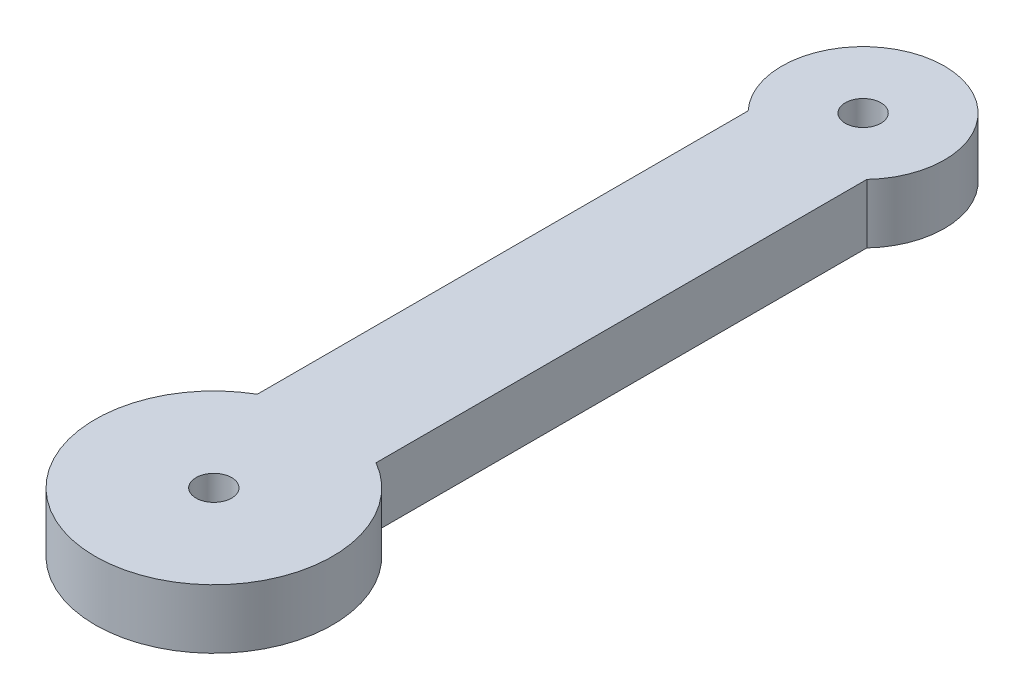
ISO-10303-21;
HEADER;
FILE_DESCRIPTION(('STEP AP214'),'2;1');
FILE_NAME('part.step','',(''),(''),'','','');
FILE_SCHEMA(('AUTOMOTIVE_DESIGN { 1 0 10303 214 1 1 1 1 }'));
ENDSEC;
DATA;
#1=APPLICATION_CONTEXT('core data for automotive mechanical design processes');
#2=APPLICATION_PROTOCOL_DEFINITION('international standard','automotive_design',2000,#1);
#3=PRODUCT_CONTEXT('',#1,'mechanical');
#4=PRODUCT('Part','Part','',(#3));
#5=PRODUCT_RELATED_PRODUCT_CATEGORY('part','',(#4));
#6=PRODUCT_DEFINITION_FORMATION('','',#4);
#7=PRODUCT_DEFINITION_CONTEXT('part definition',#1,'design');
#8=PRODUCT_DEFINITION('design','',#6,#7);
#9=PRODUCT_DEFINITION_SHAPE('','',#8);
#10=(LENGTH_UNIT() NAMED_UNIT(*) SI_UNIT(.MILLI.,.METRE.));
#11=(NAMED_UNIT(*) PLANE_ANGLE_UNIT() SI_UNIT($,.RADIAN.));
#12=(NAMED_UNIT(*) SI_UNIT($,.STERADIAN.) SOLID_ANGLE_UNIT());
#13=UNCERTAINTY_MEASURE_WITH_UNIT(LENGTH_MEASURE(1.E-05),#10,'distance_accuracy_value','');
#14=(GEOMETRIC_REPRESENTATION_CONTEXT(3) GLOBAL_UNCERTAINTY_ASSIGNED_CONTEXT((#13)) GLOBAL_UNIT_ASSIGNED_CONTEXT((#10,
#11,#12)) REPRESENTATION_CONTEXT('',''));
#15=CARTESIAN_POINT('',(0.,0.,0.));
#16=DIRECTION('',(0.,0.,1.));
#17=DIRECTION('',(1.,0.,0.));
#18=AXIS2_PLACEMENT_3D('',#15,#16,#17);
#19=CARTESIAN_POINT('',(0.,2.5,-27.3427548674483));
#20=DIRECTION('',(0.,1.,0.));
#21=DIRECTION('',(0.,0.,1.));
#22=AXIS2_PLACEMENT_3D('',#19,#20,#21);
#23=PLANE('',#22);
#24=CARTESIAN_POINT('',(0.,2.5,0.));
#25=DIRECTION('',(0.,1.,0.));
#26=DIRECTION('',(0.,0.,1.));
#27=AXIS2_PLACEMENT_3D('',#24,#25,#26);
#28=CIRCLE('',#27,0.75);
#29=CARTESIAN_POINT('',(0.,2.5,0.75));
#30=VERTEX_POINT('',#29);
#31=EDGE_CURVE('E104',#30,#30,#28,.T.);
#32=ORIENTED_EDGE('',*,*,#31,.F.);
#33=EDGE_LOOP('',(#32));
#34=FACE_BOUND('',#33,.T.);
#35=CARTESIAN_POINT('',(0.,2.5,-27.3427548674483));
#36=DIRECTION('',(0.,1.,0.));
#37=DIRECTION('',(0.,0.,1.));
#38=AXIS2_PLACEMENT_3D('',#35,#36,#37);
#39=CIRCLE('',#38,3.42614949600167);
#40=CARTESIAN_POINT('',(2.5,2.5,-25.));
#41=VERTEX_POINT('',#40);
#42=CARTESIAN_POINT('',(-2.5,2.5,-25.));
#43=VERTEX_POINT('',#42);
#44=EDGE_CURVE('E89',#41,#43,#39,.T.);
#45=ORIENTED_EDGE('',*,*,#44,.T.);
#46=DIRECTION('',(0.,0.,1.));
#47=VECTOR('',#46,1.);
#48=CARTESIAN_POINT('',(-2.5,2.5,-25.));
#49=LINE('',#48,#47);
#50=CARTESIAN_POINT('',(-2.49999999999999,2.5,-4.3301270189222));
#51=VERTEX_POINT('',#50);
#52=EDGE_CURVE('E84',#43,#51,#49,.T.);
#53=ORIENTED_EDGE('',*,*,#52,.T.);
#54=CARTESIAN_POINT('',(0.,2.5,0.));
#55=DIRECTION('',(0.,1.,0.));
#56=DIRECTION('',(0.,0.,1.));
#57=AXIS2_PLACEMENT_3D('',#54,#55,#56);
#58=CIRCLE('',#57,5.);
#59=CARTESIAN_POINT('',(2.49999999999999,2.5,-4.3301270189222));
#60=VERTEX_POINT('',#59);
#61=EDGE_CURVE('E87',#51,#60,#58,.T.);
#62=ORIENTED_EDGE('',*,*,#61,.T.);
#63=DIRECTION('',(0.,0.,-1.));
#64=VECTOR('',#63,1.);
#65=CARTESIAN_POINT('',(2.5,2.5,-25.));
#66=LINE('',#65,#64);
#67=EDGE_CURVE('E54',#60,#41,#66,.T.);
#68=ORIENTED_EDGE('',*,*,#67,.T.);
#69=EDGE_LOOP('',(#45,#53,#62,#68));
#70=FACE_BOUND('',#69,.T.);
#71=CARTESIAN_POINT('',(0.,2.5,-27.3427548674483));
#72=DIRECTION('',(0.,1.,0.));
#73=DIRECTION('',(0.,0.,1.));
#74=AXIS2_PLACEMENT_3D('',#71,#72,#73);
#75=CIRCLE('',#74,0.750000000000001);
#76=CARTESIAN_POINT('',(0.,2.5,-26.5927548674483));
#77=VERTEX_POINT('',#76);
#78=EDGE_CURVE('E119',#77,#77,#75,.T.);
#79=ORIENTED_EDGE('',*,*,#78,.F.);
#80=EDGE_LOOP('',(#79));
#81=FACE_BOUND('',#80,.T.);
#82=ADVANCED_FACE('F37',(#34,#70,#81),#23,.T.);
#83=CARTESIAN_POINT('',(0.,0.,-27.3427548674483));
#84=DIRECTION('',(0.,1.,0.));
#85=DIRECTION('',(0.,0.,1.));
#86=AXIS2_PLACEMENT_3D('',#83,#84,#85);
#87=PLANE('',#86);
#88=CARTESIAN_POINT('',(0.,0.,-27.3427548674483));
#89=DIRECTION('',(0.,1.,0.));
#90=DIRECTION('',(0.,0.,1.));
#91=AXIS2_PLACEMENT_3D('',#88,#89,#90);
#92=CIRCLE('',#91,3.42614949600167);
#93=CARTESIAN_POINT('',(2.5,0.,-25.));
#94=VERTEX_POINT('',#93);
#95=CARTESIAN_POINT('',(-2.5,0.,-25.));
#96=VERTEX_POINT('',#95);
#97=EDGE_CURVE('E101',#94,#96,#92,.T.);
#98=ORIENTED_EDGE('',*,*,#97,.F.);
#99=DIRECTION('',(0.,0.,-1.));
#100=VECTOR('',#99,1.);
#101=CARTESIAN_POINT('',(2.5,0.,-25.));
#102=LINE('',#101,#100);
#103=CARTESIAN_POINT('',(2.49999999999999,0.,-4.3301270189222));
#104=VERTEX_POINT('',#103);
#105=EDGE_CURVE('E77',#104,#94,#102,.T.);
#106=ORIENTED_EDGE('',*,*,#105,.F.);
#107=CARTESIAN_POINT('',(0.,0.,0.));
#108=DIRECTION('',(0.,1.,0.));
#109=DIRECTION('',(0.,0.,1.));
#110=AXIS2_PLACEMENT_3D('',#107,#108,#109);
#111=CIRCLE('',#110,5.);
#112=CARTESIAN_POINT('',(-2.49999999999999,0.,-4.3301270189222));
#113=VERTEX_POINT('',#112);
#114=EDGE_CURVE('E71',#113,#104,#111,.T.);
#115=ORIENTED_EDGE('',*,*,#114,.F.);
#116=DIRECTION('',(0.,0.,1.));
#117=VECTOR('',#116,1.);
#118=CARTESIAN_POINT('',(-2.5,0.,-25.));
#119=LINE('',#118,#117);
#120=EDGE_CURVE('E93',#96,#113,#119,.T.);
#121=ORIENTED_EDGE('',*,*,#120,.F.);
#122=EDGE_LOOP('',(#98,#106,#115,#121));
#123=FACE_BOUND('',#122,.T.);
#124=CARTESIAN_POINT('',(0.,0.,0.));
#125=DIRECTION('',(0.,1.,0.));
#126=DIRECTION('',(0.,0.,1.));
#127=AXIS2_PLACEMENT_3D('',#124,#125,#126);
#128=CIRCLE('',#127,0.75);
#129=CARTESIAN_POINT('',(0.,0.,0.75));
#130=VERTEX_POINT('',#129);
#131=EDGE_CURVE('E116',#130,#130,#128,.T.);
#132=ORIENTED_EDGE('',*,*,#131,.T.);
#133=EDGE_LOOP('',(#132));
#134=FACE_BOUND('',#133,.T.);
#135=CARTESIAN_POINT('',(0.,0.,-27.3427548674483));
#136=DIRECTION('',(0.,1.,0.));
#137=DIRECTION('',(0.,0.,1.));
#138=AXIS2_PLACEMENT_3D('',#135,#136,#137);
#139=CIRCLE('',#138,0.750000000000001);
#140=CARTESIAN_POINT('',(0.,0.,-26.5927548674483));
#141=VERTEX_POINT('',#140);
#142=EDGE_CURVE('E122',#141,#141,#139,.T.);
#143=ORIENTED_EDGE('',*,*,#142,.T.);
#144=EDGE_LOOP('',(#143));
#145=FACE_BOUND('',#144,.T.);
#146=ADVANCED_FACE('F112',(#123,#134,#145),#87,.F.);
#147=CARTESIAN_POINT('',(0.,2.5,-27.3427548674483));
#148=DIRECTION('',(0.,-1.,0.));
#149=DIRECTION('',(0.,0.,-1.));
#150=AXIS2_PLACEMENT_3D('',#147,#148,#149);
#151=CYLINDRICAL_SURFACE('',#150,3.42614949600167);
#152=ORIENTED_EDGE('',*,*,#97,.T.);
#153=DIRECTION('',(0.,-1.,0.));
#154=VECTOR('',#153,1.);
#155=CARTESIAN_POINT('',(-2.5,2.5,-25.));
#156=LINE('',#155,#154);
#157=EDGE_CURVE('E11',#43,#96,#156,.T.);
#158=ORIENTED_EDGE('',*,*,#157,.F.);
#159=ORIENTED_EDGE('',*,*,#44,.F.);
#160=DIRECTION('',(0.,-1.,0.));
#161=VECTOR('',#160,1.);
#162=CARTESIAN_POINT('',(2.5,2.5,-25.));
#163=LINE('',#162,#161);
#164=EDGE_CURVE('E97',#41,#94,#163,.T.);
#165=ORIENTED_EDGE('',*,*,#164,.T.);
#166=EDGE_LOOP('',(#152,#158,#159,#165));
#167=FACE_BOUND('',#166,.T.);
#168=ADVANCED_FACE('F39',(#167),#151,.T.);
#169=CARTESIAN_POINT('',(-2.5,2.5,-25.));
#170=DIRECTION('',(1.,0.,0.));
#171=DIRECTION('',(0.,0.,-1.));
#172=AXIS2_PLACEMENT_3D('',#169,#170,#171);
#173=PLANE('',#172);
#174=ORIENTED_EDGE('',*,*,#120,.T.);
#175=DIRECTION('',(0.,-1.,0.));
#176=VECTOR('',#175,1.);
#177=CARTESIAN_POINT('',(-2.49999999999999,2.5,-4.3301270189222));
#178=LINE('',#177,#176);
#179=EDGE_CURVE('E46',#51,#113,#178,.T.);
#180=ORIENTED_EDGE('',*,*,#179,.F.);
#181=ORIENTED_EDGE('',*,*,#52,.F.);
#182=ORIENTED_EDGE('',*,*,#157,.T.);
#183=EDGE_LOOP('',(#174,#180,#181,#182));
#184=FACE_BOUND('',#183,.T.);
#185=ADVANCED_FACE('F92',(#184),#173,.F.);
#186=CARTESIAN_POINT('',(0.,2.5,0.));
#187=DIRECTION('',(0.,-1.,0.));
#188=DIRECTION('',(0.,0.,-1.));
#189=AXIS2_PLACEMENT_3D('',#186,#187,#188);
#190=CYLINDRICAL_SURFACE('',#189,5.);
#191=ORIENTED_EDGE('',*,*,#114,.T.);
#192=DIRECTION('',(0.,-1.,0.));
#193=VECTOR('',#192,1.);
#194=CARTESIAN_POINT('',(2.49999999999999,2.5,-4.3301270189222));
#195=LINE('',#194,#193);
#196=EDGE_CURVE('E94',#60,#104,#195,.T.);
#197=ORIENTED_EDGE('',*,*,#196,.F.);
#198=ORIENTED_EDGE('',*,*,#61,.F.);
#199=ORIENTED_EDGE('',*,*,#179,.T.);
#200=EDGE_LOOP('',(#191,#197,#198,#199));
#201=FACE_BOUND('',#200,.T.);
#202=ADVANCED_FACE('F95',(#201),#190,.T.);
#203=CARTESIAN_POINT('',(2.5,2.5,-25.));
#204=DIRECTION('',(-1.,0.,0.));
#205=DIRECTION('',(0.,0.,1.));
#206=AXIS2_PLACEMENT_3D('',#203,#204,#205);
#207=PLANE('',#206);
#208=ORIENTED_EDGE('',*,*,#105,.T.);
#209=ORIENTED_EDGE('',*,*,#164,.F.);
#210=ORIENTED_EDGE('',*,*,#67,.F.);
#211=ORIENTED_EDGE('',*,*,#196,.T.);
#212=EDGE_LOOP('',(#208,#209,#210,#211));
#213=FACE_BOUND('',#212,.T.);
#214=ADVANCED_FACE('F109',(#213),#207,.F.);
#215=CARTESIAN_POINT('',(0.,2.5,0.));
#216=DIRECTION('',(0.,-1.,0.));
#217=DIRECTION('',(0.,0.,-1.));
#218=AXIS2_PLACEMENT_3D('',#215,#216,#217);
#219=CYLINDRICAL_SURFACE('',#218,0.75);
#220=ORIENTED_EDGE('',*,*,#31,.T.);
#221=EDGE_LOOP('',(#220));
#222=FACE_BOUND('',#221,.T.);
#223=ORIENTED_EDGE('',*,*,#131,.F.);
#224=EDGE_LOOP('',(#223));
#225=FACE_BOUND('',#224,.T.);
#226=ADVANCED_FACE('F139',(#222,#225),#219,.F.);
#227=CARTESIAN_POINT('',(0.,2.5,-27.3427548674483));
#228=DIRECTION('',(0.,-1.,0.));
#229=DIRECTION('',(0.,0.,-1.));
#230=AXIS2_PLACEMENT_3D('',#227,#228,#229);
#231=CYLINDRICAL_SURFACE('',#230,0.750000000000001);
#232=ORIENTED_EDGE('',*,*,#78,.T.);
#233=EDGE_LOOP('',(#232));
#234=FACE_BOUND('',#233,.T.);
#235=ORIENTED_EDGE('',*,*,#142,.F.);
#236=EDGE_LOOP('',(#235));
#237=FACE_BOUND('',#236,.T.);
#238=ADVANCED_FACE('F128',(#234,#237),#231,.F.);
#239=CLOSED_SHELL('',(#82,#146,#168,#185,#202,#214,#226,#238));
#240=MANIFOLD_SOLID_BREP('B2',#239);
#241=ADVANCED_BREP_SHAPE_REPRESENTATION('',(#18,#240),#14);
#242=SHAPE_DEFINITION_REPRESENTATION(#9,#241);
ENDSEC;
END-ISO-10303-21;
